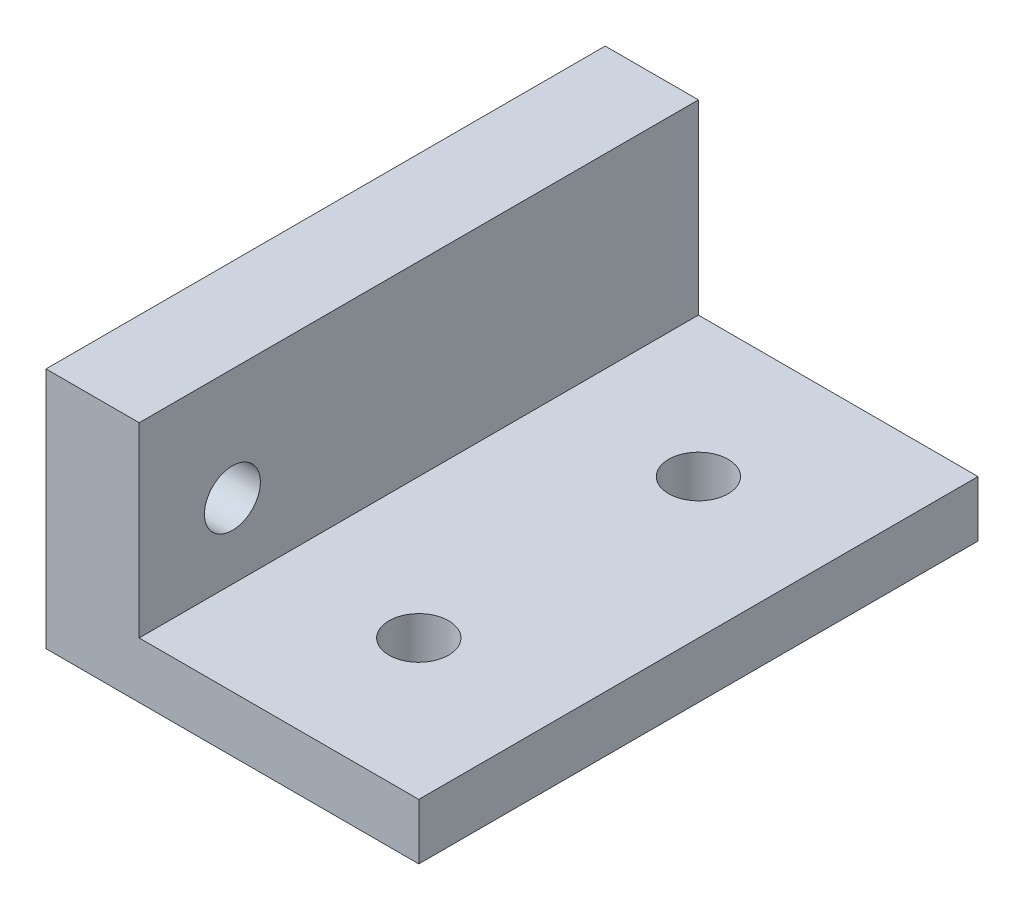
ISO-10303-21;
HEADER;
FILE_DESCRIPTION(('STEP AP214'),'2;1');
FILE_NAME('part.step','',(''),(''),'','','');
FILE_SCHEMA(('AUTOMOTIVE_DESIGN { 1 0 10303 214 1 1 1 1 }'));
ENDSEC;
DATA;
#1=APPLICATION_CONTEXT('core data for automotive mechanical design processes');
#2=APPLICATION_PROTOCOL_DEFINITION('international standard','automotive_design',2000,#1);
#3=PRODUCT_CONTEXT('',#1,'mechanical');
#4=PRODUCT('Part','Part','',(#3));
#5=PRODUCT_RELATED_PRODUCT_CATEGORY('part','',(#4));
#6=PRODUCT_DEFINITION_FORMATION('','',#4);
#7=PRODUCT_DEFINITION_CONTEXT('part definition',#1,'design');
#8=PRODUCT_DEFINITION('design','',#6,#7);
#9=PRODUCT_DEFINITION_SHAPE('','',#8);
#10=(LENGTH_UNIT() NAMED_UNIT(*) SI_UNIT(.MILLI.,.METRE.));
#11=(NAMED_UNIT(*) PLANE_ANGLE_UNIT() SI_UNIT($,.RADIAN.));
#12=(NAMED_UNIT(*) SI_UNIT($,.STERADIAN.) SOLID_ANGLE_UNIT());
#13=UNCERTAINTY_MEASURE_WITH_UNIT(LENGTH_MEASURE(1.E-05),#10,'distance_accuracy_value','');
#14=(GEOMETRIC_REPRESENTATION_CONTEXT(3) GLOBAL_UNCERTAINTY_ASSIGNED_CONTEXT((#13)) GLOBAL_UNIT_ASSIGNED_CONTEXT((#10,
#11,#12)) REPRESENTATION_CONTEXT('',''));
#15=CARTESIAN_POINT('',(0.,0.,0.));
#16=DIRECTION('',(0.,0.,1.));
#17=DIRECTION('',(1.,0.,0.));
#18=AXIS2_PLACEMENT_3D('',#15,#16,#17);
#19=CARTESIAN_POINT('',(10.,3.,-15.));
#20=DIRECTION('',(-1.,0.,0.));
#21=DIRECTION('',(0.,0.,1.));
#22=AXIS2_PLACEMENT_3D('',#19,#20,#21);
#23=PLANE('',#22);
#24=DIRECTION('',(0.,0.,-1.));
#25=VECTOR('',#24,1.);
#26=CARTESIAN_POINT('',(10.,0.,-15.));
#27=LINE('',#26,#25);
#28=CARTESIAN_POINT('',(10.,0.,15.));
#29=VERTEX_POINT('',#28);
#30=CARTESIAN_POINT('',(10.,0.,-15.));
#31=VERTEX_POINT('',#30);
#32=EDGE_CURVE('E100',#29,#31,#27,.T.);
#33=ORIENTED_EDGE('',*,*,#32,.T.);
#34=DIRECTION('',(0.,-1.,0.));
#35=VECTOR('',#34,1.);
#36=CARTESIAN_POINT('',(10.,3.,-15.));
#37=LINE('',#36,#35);
#38=CARTESIAN_POINT('',(10.,3.,-15.));
#39=VERTEX_POINT('',#38);
#40=EDGE_CURVE('E11',#39,#31,#37,.T.);
#41=ORIENTED_EDGE('',*,*,#40,.F.);
#42=DIRECTION('',(0.,0.,-1.));
#43=VECTOR('',#42,1.);
#44=CARTESIAN_POINT('',(10.,3.,-15.));
#45=LINE('',#44,#43);
#46=CARTESIAN_POINT('',(10.,3.,15.));
#47=VERTEX_POINT('',#46);
#48=EDGE_CURVE('E94',#47,#39,#45,.T.);
#49=ORIENTED_EDGE('',*,*,#48,.F.);
#50=DIRECTION('',(0.,-1.,0.));
#51=VECTOR('',#50,1.);
#52=CARTESIAN_POINT('',(10.,3.,15.));
#53=LINE('',#52,#51);
#54=EDGE_CURVE('E85',#47,#29,#53,.T.);
#55=ORIENTED_EDGE('',*,*,#54,.T.);
#56=EDGE_LOOP('',(#33,#41,#49,#55));
#57=FACE_BOUND('',#56,.T.);
#58=ADVANCED_FACE('F41',(#57),#23,.F.);
#59=CARTESIAN_POINT('',(-10.,3.,-15.));
#60=DIRECTION('',(0.,0.,1.));
#61=DIRECTION('',(1.,0.,0.));
#62=AXIS2_PLACEMENT_3D('',#59,#60,#61);
#63=PLANE('',#62);
#64=DIRECTION('',(-1.,0.,0.));
#65=VECTOR('',#64,1.);
#66=CARTESIAN_POINT('',(-10.,0.,-15.));
#67=LINE('',#66,#65);
#68=CARTESIAN_POINT('',(-10.,0.,-15.));
#69=VERTEX_POINT('',#68);
#70=EDGE_CURVE('E104',#31,#69,#67,.T.);
#71=ORIENTED_EDGE('',*,*,#70,.T.);
#72=DIRECTION('',(0.,-1.,0.));
#73=VECTOR('',#72,1.);
#74=CARTESIAN_POINT('',(-10.,3.,-15.));
#75=LINE('',#74,#73);
#76=CARTESIAN_POINT('',(-10.,13.,-15.));
#77=VERTEX_POINT('',#76);
#78=EDGE_CURVE('E50',#77,#69,#75,.T.);
#79=ORIENTED_EDGE('',*,*,#78,.F.);
#80=DIRECTION('',(-1.,0.,0.));
#81=VECTOR('',#80,1.);
#82=CARTESIAN_POINT('',(-10.,13.,-15.));
#83=LINE('',#82,#81);
#84=CARTESIAN_POINT('',(-5.,13.,-15.));
#85=VERTEX_POINT('',#84);
#86=EDGE_CURVE('E135',#85,#77,#83,.T.);
#87=ORIENTED_EDGE('',*,*,#86,.F.);
#88=DIRECTION('',(0.,-1.,0.));
#89=VECTOR('',#88,1.);
#90=CARTESIAN_POINT('',(-5.,13.,-15.));
#91=LINE('',#90,#89);
#92=CARTESIAN_POINT('',(-5.,3.,-15.));
#93=VERTEX_POINT('',#92);
#94=EDGE_CURVE('E112',#85,#93,#91,.T.);
#95=ORIENTED_EDGE('',*,*,#94,.T.);
#96=DIRECTION('',(-1.,0.,0.));
#97=VECTOR('',#96,1.);
#98=CARTESIAN_POINT('',(-10.,3.,-15.));
#99=LINE('',#98,#97);
#100=EDGE_CURVE('E157',#39,#93,#99,.T.);
#101=ORIENTED_EDGE('',*,*,#100,.F.);
#102=ORIENTED_EDGE('',*,*,#40,.T.);
#103=EDGE_LOOP('',(#71,#79,#87,#95,#101,#102));
#104=FACE_BOUND('',#103,.T.);
#105=ADVANCED_FACE('F132',(#104),#63,.F.);
#106=CARTESIAN_POINT('',(-10.,3.,-15.));
#107=DIRECTION('',(1.,0.,0.));
#108=DIRECTION('',(0.,0.,-1.));
#109=AXIS2_PLACEMENT_3D('',#106,#107,#108);
#110=PLANE('',#109);
#111=CARTESIAN_POINT('',(-10.,7.,10.));
#112=DIRECTION('',(-1.,0.,0.));
#113=DIRECTION('',(0.,0.,1.));
#114=AXIS2_PLACEMENT_3D('',#111,#112,#113);
#115=CIRCLE('',#114,1.5);
#116=CARTESIAN_POINT('',(-10.,7.,11.5));
#117=VERTEX_POINT('',#116);
#118=EDGE_CURVE('E173',#117,#117,#115,.T.);
#119=ORIENTED_EDGE('',*,*,#118,.F.);
#120=EDGE_LOOP('',(#119));
#121=FACE_BOUND('',#120,.T.);
#122=DIRECTION('',(0.,0.,1.));
#123=VECTOR('',#122,1.);
#124=CARTESIAN_POINT('',(-10.,0.,-15.));
#125=LINE('',#124,#123);
#126=CARTESIAN_POINT('',(-10.,0.,15.));
#127=VERTEX_POINT('',#126);
#128=EDGE_CURVE('E95',#69,#127,#125,.T.);
#129=ORIENTED_EDGE('',*,*,#128,.T.);
#130=DIRECTION('',(0.,-1.,0.));
#131=VECTOR('',#130,1.);
#132=CARTESIAN_POINT('',(-10.,3.,15.));
#133=LINE('',#132,#131);
#134=CARTESIAN_POINT('',(-10.,13.,15.));
#135=VERTEX_POINT('',#134);
#136=EDGE_CURVE('E89',#135,#127,#133,.T.);
#137=ORIENTED_EDGE('',*,*,#136,.F.);
#138=DIRECTION('',(0.,0.,1.));
#139=VECTOR('',#138,1.);
#140=CARTESIAN_POINT('',(-10.,13.,-15.));
#141=LINE('',#140,#139);
#142=EDGE_CURVE('E128',#77,#135,#141,.T.);
#143=ORIENTED_EDGE('',*,*,#142,.F.);
#144=ORIENTED_EDGE('',*,*,#78,.T.);
#145=EDGE_LOOP('',(#129,#137,#143,#144));
#146=FACE_BOUND('',#145,.T.);
#147=ADVANCED_FACE('F126',(#121,#146),#110,.F.);
#148=CARTESIAN_POINT('',(-10.,3.,15.));
#149=DIRECTION('',(0.,0.,-1.));
#150=DIRECTION('',(-1.,0.,0.));
#151=AXIS2_PLACEMENT_3D('',#148,#149,#150);
#152=PLANE('',#151);
#153=DIRECTION('',(1.,0.,0.));
#154=VECTOR('',#153,1.);
#155=CARTESIAN_POINT('',(-10.,0.,15.));
#156=LINE('',#155,#154);
#157=EDGE_CURVE('E82',#127,#29,#156,.T.);
#158=ORIENTED_EDGE('',*,*,#157,.T.);
#159=ORIENTED_EDGE('',*,*,#54,.F.);
#160=DIRECTION('',(1.,0.,0.));
#161=VECTOR('',#160,1.);
#162=CARTESIAN_POINT('',(-10.,3.,15.));
#163=LINE('',#162,#161);
#164=CARTESIAN_POINT('',(-5.,3.,15.));
#165=VERTEX_POINT('',#164);
#166=EDGE_CURVE('E62',#165,#47,#163,.T.);
#167=ORIENTED_EDGE('',*,*,#166,.F.);
#168=DIRECTION('',(0.,-1.,0.));
#169=VECTOR('',#168,1.);
#170=CARTESIAN_POINT('',(-5.,13.,15.));
#171=LINE('',#170,#169);
#172=CARTESIAN_POINT('',(-5.,13.,15.));
#173=VERTEX_POINT('',#172);
#174=EDGE_CURVE('E106',#173,#165,#171,.T.);
#175=ORIENTED_EDGE('',*,*,#174,.F.);
#176=DIRECTION('',(1.,0.,0.));
#177=VECTOR('',#176,1.);
#178=CARTESIAN_POINT('',(-10.,13.,15.));
#179=LINE('',#178,#177);
#180=EDGE_CURVE('E150',#135,#173,#179,.T.);
#181=ORIENTED_EDGE('',*,*,#180,.F.);
#182=ORIENTED_EDGE('',*,*,#136,.T.);
#183=EDGE_LOOP('',(#158,#159,#167,#175,#181,#182));
#184=FACE_BOUND('',#183,.T.);
#185=ADVANCED_FACE('F84',(#184),#152,.F.);
#186=CARTESIAN_POINT('',(0.,3.,0.));
#187=DIRECTION('',(0.,1.,0.));
#188=DIRECTION('',(0.,0.,1.));
#189=AXIS2_PLACEMENT_3D('',#186,#187,#188);
#190=PLANE('',#189);
#191=CARTESIAN_POINT('',(2.5,3.,7.5));
#192=DIRECTION('',(0.,1.,0.));
#193=DIRECTION('',(0.,0.,1.));
#194=AXIS2_PLACEMENT_3D('',#191,#192,#193);
#195=CIRCLE('',#194,1.6);
#196=CARTESIAN_POINT('',(2.5,3.,9.1));
#197=VERTEX_POINT('',#196);
#198=EDGE_CURVE('E186',#197,#197,#195,.T.);
#199=ORIENTED_EDGE('',*,*,#198,.F.);
#200=EDGE_LOOP('',(#199));
#201=FACE_BOUND('',#200,.T.);
#202=CARTESIAN_POINT('',(2.5,3.,-7.5));
#203=DIRECTION('',(0.,1.,0.));
#204=DIRECTION('',(0.,0.,1.));
#205=AXIS2_PLACEMENT_3D('',#202,#203,#204);
#206=CIRCLE('',#205,1.6);
#207=CARTESIAN_POINT('',(2.5,3.,-5.9));
#208=VERTEX_POINT('',#207);
#209=EDGE_CURVE('E178',#208,#208,#206,.T.);
#210=ORIENTED_EDGE('',*,*,#209,.F.);
#211=EDGE_LOOP('',(#210));
#212=FACE_BOUND('',#211,.T.);
#213=DIRECTION('',(0.,0.,-1.));
#214=VECTOR('',#213,1.);
#215=CARTESIAN_POINT('',(-5.,3.,-15.));
#216=LINE('',#215,#214);
#217=EDGE_CURVE('E57',#165,#93,#216,.T.);
#218=ORIENTED_EDGE('',*,*,#217,.F.);
#219=ORIENTED_EDGE('',*,*,#166,.T.);
#220=ORIENTED_EDGE('',*,*,#48,.T.);
#221=ORIENTED_EDGE('',*,*,#100,.T.);
#222=EDGE_LOOP('',(#218,#219,#220,#221));
#223=FACE_BOUND('',#222,.T.);
#224=ADVANCED_FACE('F161',(#201,#212,#223),#190,.T.);
#225=CARTESIAN_POINT('',(0.,0.,0.));
#226=DIRECTION('',(0.,1.,0.));
#227=DIRECTION('',(0.,0.,1.));
#228=AXIS2_PLACEMENT_3D('',#225,#226,#227);
#229=PLANE('',#228);
#230=CARTESIAN_POINT('',(2.5,0.,7.5));
#231=DIRECTION('',(0.,1.,0.));
#232=DIRECTION('',(0.,0.,1.));
#233=AXIS2_PLACEMENT_3D('',#230,#231,#232);
#234=CIRCLE('',#233,1.6);
#235=CARTESIAN_POINT('',(2.5,0.,9.1));
#236=VERTEX_POINT('',#235);
#237=EDGE_CURVE('E177',#236,#236,#234,.T.);
#238=ORIENTED_EDGE('',*,*,#237,.T.);
#239=EDGE_LOOP('',(#238));
#240=FACE_BOUND('',#239,.T.);
#241=CARTESIAN_POINT('',(2.5,0.,-7.5));
#242=DIRECTION('',(0.,1.,0.));
#243=DIRECTION('',(0.,0.,1.));
#244=AXIS2_PLACEMENT_3D('',#241,#242,#243);
#245=CIRCLE('',#244,1.6);
#246=CARTESIAN_POINT('',(2.5,0.,-5.9));
#247=VERTEX_POINT('',#246);
#248=EDGE_CURVE('E182',#247,#247,#245,.T.);
#249=ORIENTED_EDGE('',*,*,#248,.T.);
#250=EDGE_LOOP('',(#249));
#251=FACE_BOUND('',#250,.T.);
#252=ORIENTED_EDGE('',*,*,#32,.F.);
#253=ORIENTED_EDGE('',*,*,#157,.F.);
#254=ORIENTED_EDGE('',*,*,#128,.F.);
#255=ORIENTED_EDGE('',*,*,#70,.F.);
#256=EDGE_LOOP('',(#252,#253,#254,#255));
#257=FACE_BOUND('',#256,.T.);
#258=ADVANCED_FACE('F103',(#240,#251,#257),#229,.F.);
#259=CARTESIAN_POINT('',(-5.,13.,-15.));
#260=DIRECTION('',(-1.,0.,0.));
#261=DIRECTION('',(0.,0.,1.));
#262=AXIS2_PLACEMENT_3D('',#259,#260,#261);
#263=PLANE('',#262);
#264=CARTESIAN_POINT('',(-5.,7.,10.));
#265=DIRECTION('',(-1.,0.,0.));
#266=DIRECTION('',(0.,0.,1.));
#267=AXIS2_PLACEMENT_3D('',#264,#265,#266);
#268=CIRCLE('',#267,1.5);
#269=CARTESIAN_POINT('',(-5.,7.,11.5));
#270=VERTEX_POINT('',#269);
#271=EDGE_CURVE('E44',#270,#270,#268,.T.);
#272=ORIENTED_EDGE('',*,*,#271,.T.);
#273=EDGE_LOOP('',(#272));
#274=FACE_BOUND('',#273,.T.);
#275=ORIENTED_EDGE('',*,*,#217,.T.);
#276=ORIENTED_EDGE('',*,*,#94,.F.);
#277=DIRECTION('',(0.,0.,-1.));
#278=VECTOR('',#277,1.);
#279=CARTESIAN_POINT('',(-5.,13.,-15.));
#280=LINE('',#279,#278);
#281=EDGE_CURVE('E143',#173,#85,#280,.T.);
#282=ORIENTED_EDGE('',*,*,#281,.F.);
#283=ORIENTED_EDGE('',*,*,#174,.T.);
#284=EDGE_LOOP('',(#275,#276,#282,#283));
#285=FACE_BOUND('',#284,.T.);
#286=ADVANCED_FACE('F163',(#274,#285),#263,.F.);
#287=CARTESIAN_POINT('',(0.,13.,0.));
#288=DIRECTION('',(0.,1.,0.));
#289=DIRECTION('',(0.,0.,1.));
#290=AXIS2_PLACEMENT_3D('',#287,#288,#289);
#291=PLANE('',#290);
#292=ORIENTED_EDGE('',*,*,#142,.T.);
#293=ORIENTED_EDGE('',*,*,#180,.T.);
#294=ORIENTED_EDGE('',*,*,#281,.T.);
#295=ORIENTED_EDGE('',*,*,#86,.T.);
#296=EDGE_LOOP('',(#292,#293,#294,#295));
#297=FACE_BOUND('',#296,.T.);
#298=ADVANCED_FACE('F139',(#297),#291,.T.);
#299=CARTESIAN_POINT('',(0.,7.,10.));
#300=DIRECTION('',(-1.,0.,0.));
#301=DIRECTION('',(0.,0.,1.));
#302=AXIS2_PLACEMENT_3D('',#299,#300,#301);
#303=CYLINDRICAL_SURFACE('',#302,1.5);
#304=ORIENTED_EDGE('',*,*,#118,.T.);
#305=EDGE_LOOP('',(#304));
#306=FACE_BOUND('',#305,.T.);
#307=ORIENTED_EDGE('',*,*,#271,.F.);
#308=EDGE_LOOP('',(#307));
#309=FACE_BOUND('',#308,.T.);
#310=ADVANCED_FACE('F209',(#306,#309),#303,.F.);
#311=CARTESIAN_POINT('',(2.5,0.,-7.5));
#312=DIRECTION('',(0.,1.,0.));
#313=DIRECTION('',(0.,0.,1.));
#314=AXIS2_PLACEMENT_3D('',#311,#312,#313);
#315=CYLINDRICAL_SURFACE('',#314,1.6);
#316=ORIENTED_EDGE('',*,*,#248,.F.);
#317=EDGE_LOOP('',(#316));
#318=FACE_BOUND('',#317,.T.);
#319=ORIENTED_EDGE('',*,*,#209,.T.);
#320=EDGE_LOOP('',(#319));
#321=FACE_BOUND('',#320,.T.);
#322=ADVANCED_FACE('F199',(#318,#321),#315,.F.);
#323=CARTESIAN_POINT('',(2.5,0.,7.5));
#324=DIRECTION('',(0.,1.,0.));
#325=DIRECTION('',(0.,0.,1.));
#326=AXIS2_PLACEMENT_3D('',#323,#324,#325);
#327=CYLINDRICAL_SURFACE('',#326,1.6);
#328=ORIENTED_EDGE('',*,*,#237,.F.);
#329=EDGE_LOOP('',(#328));
#330=FACE_BOUND('',#329,.T.);
#331=ORIENTED_EDGE('',*,*,#198,.T.);
#332=EDGE_LOOP('',(#331));
#333=FACE_BOUND('',#332,.T.);
#334=ADVANCED_FACE('F196',(#330,#333),#327,.F.);
#335=CLOSED_SHELL('',(#58,#105,#147,#185,#224,#258,#286,#298,#310,#322,#334));
#336=MANIFOLD_SOLID_BREP('B2',#335);
#337=ADVANCED_BREP_SHAPE_REPRESENTATION('',(#18,#336),#14);
#338=SHAPE_DEFINITION_REPRESENTATION(#9,#337);
ENDSEC;
END-ISO-10303-21;
